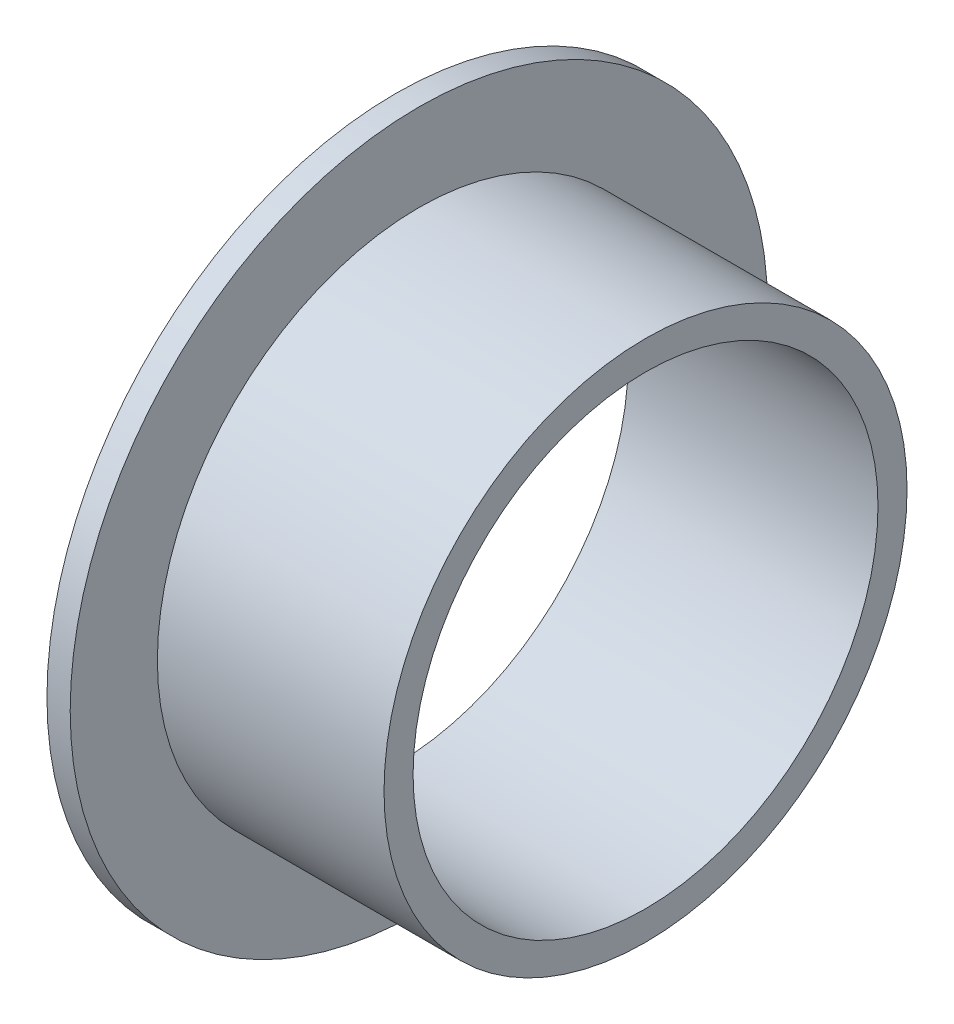
ISO-10303-21;
HEADER;
FILE_DESCRIPTION(('STEP AP214'),'2;1');
FILE_NAME('part.step','',(''),(''),'','','');
FILE_SCHEMA(('AUTOMOTIVE_DESIGN { 1 0 10303 214 1 1 1 1 }'));
ENDSEC;
DATA;
#1=APPLICATION_CONTEXT('core data for automotive mechanical design processes');
#2=APPLICATION_PROTOCOL_DEFINITION('international standard','automotive_design',2000,#1);
#3=PRODUCT_CONTEXT('',#1,'mechanical');
#4=PRODUCT('Part','Part','',(#3));
#5=PRODUCT_RELATED_PRODUCT_CATEGORY('part','',(#4));
#6=PRODUCT_DEFINITION_FORMATION('','',#4);
#7=PRODUCT_DEFINITION_CONTEXT('part definition',#1,'design');
#8=PRODUCT_DEFINITION('design','',#6,#7);
#9=PRODUCT_DEFINITION_SHAPE('','',#8);
#10=(LENGTH_UNIT() NAMED_UNIT(*) SI_UNIT(.MILLI.,.METRE.));
#11=(NAMED_UNIT(*) PLANE_ANGLE_UNIT() SI_UNIT($,.RADIAN.));
#12=(NAMED_UNIT(*) SI_UNIT($,.STERADIAN.) SOLID_ANGLE_UNIT());
#13=UNCERTAINTY_MEASURE_WITH_UNIT(LENGTH_MEASURE(1.E-05),#10,'distance_accuracy_value','');
#14=(GEOMETRIC_REPRESENTATION_CONTEXT(3) GLOBAL_UNCERTAINTY_ASSIGNED_CONTEXT((#13)) GLOBAL_UNIT_ASSIGNED_CONTEXT((#10,
#11,#12)) REPRESENTATION_CONTEXT('',''));
#15=CARTESIAN_POINT('',(0.,0.,0.));
#16=DIRECTION('',(0.,0.,1.));
#17=DIRECTION('',(1.,0.,0.));
#18=AXIS2_PLACEMENT_3D('',#15,#16,#17);
#19=CARTESIAN_POINT('',(0.,12.,0.));
#20=DIRECTION('',(1.,0.,0.));
#21=DIRECTION('',(0.,0.,-1.));
#22=AXIS2_PLACEMENT_3D('',#19,#20,#21);
#23=PLANE('',#22);
#24=CARTESIAN_POINT('',(0.,0.,0.));
#25=DIRECTION('',(-1.,0.,0.));
#26=DIRECTION('',(0.,0.,1.));
#27=AXIS2_PLACEMENT_3D('',#24,#25,#26);
#28=CIRCLE('',#27,8.);
#29=CARTESIAN_POINT('',(0.,0.,8.));
#30=VERTEX_POINT('',#29);
#31=EDGE_CURVE('E10',#30,#30,#28,.T.);
#32=ORIENTED_EDGE('',*,*,#31,.F.);
#33=EDGE_LOOP('',(#32));
#34=FACE_BOUND('',#33,.T.);
#35=CARTESIAN_POINT('',(0.,0.,0.));
#36=DIRECTION('',(-1.,0.,0.));
#37=DIRECTION('',(0.,0.,1.));
#38=AXIS2_PLACEMENT_3D('',#35,#36,#37);
#39=CIRCLE('',#38,12.);
#40=CARTESIAN_POINT('',(0.,0.,12.));
#41=VERTEX_POINT('',#40);
#42=EDGE_CURVE('E57',#41,#41,#39,.T.);
#43=ORIENTED_EDGE('',*,*,#42,.T.);
#44=EDGE_LOOP('',(#43));
#45=FACE_BOUND('',#44,.T.);
#46=ADVANCED_FACE('F35',(#34,#45),#23,.F.);
#47=CARTESIAN_POINT('',(0.,0.,0.));
#48=DIRECTION('',(-1.,0.,0.));
#49=DIRECTION('',(0.,0.,1.));
#50=AXIS2_PLACEMENT_3D('',#47,#48,#49);
#51=CYLINDRICAL_SURFACE('',#50,8.);
#52=CARTESIAN_POINT('',(8.6,0.,0.));
#53=DIRECTION('',(-1.,0.,0.));
#54=DIRECTION('',(0.,0.,1.));
#55=AXIS2_PLACEMENT_3D('',#52,#53,#54);
#56=CIRCLE('',#55,8.);
#57=CARTESIAN_POINT('',(8.6,0.,8.));
#58=VERTEX_POINT('',#57);
#59=EDGE_CURVE('E41',#58,#58,#56,.T.);
#60=ORIENTED_EDGE('',*,*,#59,.F.);
#61=EDGE_LOOP('',(#60));
#62=FACE_BOUND('',#61,.T.);
#63=ORIENTED_EDGE('',*,*,#31,.T.);
#64=EDGE_LOOP('',(#63));
#65=FACE_BOUND('',#64,.T.);
#66=ADVANCED_FACE('F82',(#62,#65),#51,.F.);
#67=CARTESIAN_POINT('',(8.6,8.,0.));
#68=DIRECTION('',(-1.,0.,0.));
#69=DIRECTION('',(0.,0.,1.));
#70=AXIS2_PLACEMENT_3D('',#67,#68,#69);
#71=PLANE('',#70);
#72=CARTESIAN_POINT('',(8.6,0.,0.));
#73=DIRECTION('',(-1.,0.,0.));
#74=DIRECTION('',(0.,0.,1.));
#75=AXIS2_PLACEMENT_3D('',#72,#73,#74);
#76=CIRCLE('',#75,9.);
#77=CARTESIAN_POINT('',(8.6,0.,9.));
#78=VERTEX_POINT('',#77);
#79=EDGE_CURVE('E45',#78,#78,#76,.T.);
#80=ORIENTED_EDGE('',*,*,#79,.F.);
#81=EDGE_LOOP('',(#80));
#82=FACE_BOUND('',#81,.T.);
#83=ORIENTED_EDGE('',*,*,#59,.T.);
#84=EDGE_LOOP('',(#83));
#85=FACE_BOUND('',#84,.T.);
#86=ADVANCED_FACE('F77',(#82,#85),#71,.F.);
#87=CARTESIAN_POINT('',(0.,0.,0.));
#88=DIRECTION('',(-1.,0.,0.));
#89=DIRECTION('',(0.,0.,1.));
#90=AXIS2_PLACEMENT_3D('',#87,#88,#89);
#91=CYLINDRICAL_SURFACE('',#90,9.);
#92=CARTESIAN_POINT('',(0.8,0.,0.));
#93=DIRECTION('',(-1.,0.,0.));
#94=DIRECTION('',(0.,0.,1.));
#95=AXIS2_PLACEMENT_3D('',#92,#93,#94);
#96=CIRCLE('',#95,9.);
#97=CARTESIAN_POINT('',(0.8,0.,9.));
#98=VERTEX_POINT('',#97);
#99=EDGE_CURVE('E49',#98,#98,#96,.T.);
#100=ORIENTED_EDGE('',*,*,#99,.F.);
#101=EDGE_LOOP('',(#100));
#102=FACE_BOUND('',#101,.T.);
#103=ORIENTED_EDGE('',*,*,#79,.T.);
#104=EDGE_LOOP('',(#103));
#105=FACE_BOUND('',#104,.T.);
#106=ADVANCED_FACE('F71',(#102,#105),#91,.T.);
#107=CARTESIAN_POINT('',(0.8,9.,0.));
#108=DIRECTION('',(-1.,0.,0.));
#109=DIRECTION('',(0.,0.,1.));
#110=AXIS2_PLACEMENT_3D('',#107,#108,#109);
#111=PLANE('',#110);
#112=CARTESIAN_POINT('',(0.8,0.,0.));
#113=DIRECTION('',(-1.,0.,0.));
#114=DIRECTION('',(0.,0.,1.));
#115=AXIS2_PLACEMENT_3D('',#112,#113,#114);
#116=CIRCLE('',#115,12.);
#117=CARTESIAN_POINT('',(0.8,0.,12.));
#118=VERTEX_POINT('',#117);
#119=EDGE_CURVE('E54',#118,#118,#116,.T.);
#120=ORIENTED_EDGE('',*,*,#119,.F.);
#121=EDGE_LOOP('',(#120));
#122=FACE_BOUND('',#121,.T.);
#123=ORIENTED_EDGE('',*,*,#99,.T.);
#124=EDGE_LOOP('',(#123));
#125=FACE_BOUND('',#124,.T.);
#126=ADVANCED_FACE('F65',(#122,#125),#111,.F.);
#127=CARTESIAN_POINT('',(0.,0.,0.));
#128=DIRECTION('',(-1.,0.,0.));
#129=DIRECTION('',(0.,0.,1.));
#130=AXIS2_PLACEMENT_3D('',#127,#128,#129);
#131=CYLINDRICAL_SURFACE('',#130,12.);
#132=ORIENTED_EDGE('',*,*,#42,.F.);
#133=EDGE_LOOP('',(#132));
#134=FACE_BOUND('',#133,.T.);
#135=ORIENTED_EDGE('',*,*,#119,.T.);
#136=EDGE_LOOP('',(#135));
#137=FACE_BOUND('',#136,.T.);
#138=ADVANCED_FACE('F62',(#134,#137),#131,.T.);
#139=CLOSED_SHELL('',(#46,#66,#86,#106,#126,#138));
#140=MANIFOLD_SOLID_BREP('B2',#139);
#141=ADVANCED_BREP_SHAPE_REPRESENTATION('',(#18,#140),#14);
#142=SHAPE_DEFINITION_REPRESENTATION(#9,#141);
ENDSEC;
END-ISO-10303-21;
